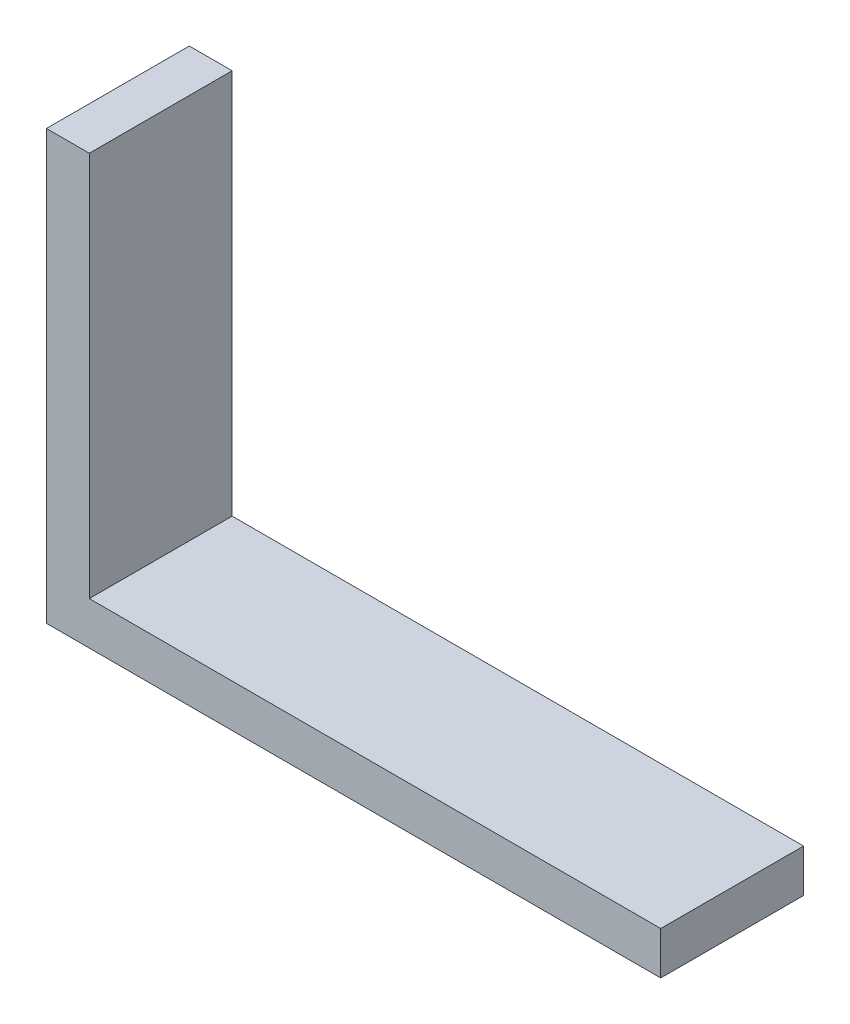
ISO-10303-21;
HEADER;
FILE_DESCRIPTION(('STEP AP214'),'2;1');
FILE_NAME('part.step','',(''),(''),'','','');
FILE_SCHEMA(('AUTOMOTIVE_DESIGN { 1 0 10303 214 1 1 1 1 }'));
ENDSEC;
DATA;
#1=APPLICATION_CONTEXT('core data for automotive mechanical design processes');
#2=APPLICATION_PROTOCOL_DEFINITION('international standard','automotive_design',2000,#1);
#3=PRODUCT_CONTEXT('',#1,'mechanical');
#4=PRODUCT('Part','Part','',(#3));
#5=PRODUCT_RELATED_PRODUCT_CATEGORY('part','',(#4));
#6=PRODUCT_DEFINITION_FORMATION('','',#4);
#7=PRODUCT_DEFINITION_CONTEXT('part definition',#1,'design');
#8=PRODUCT_DEFINITION('design','',#6,#7);
#9=PRODUCT_DEFINITION_SHAPE('','',#8);
#10=(LENGTH_UNIT() NAMED_UNIT(*) SI_UNIT(.MILLI.,.METRE.));
#11=(NAMED_UNIT(*) PLANE_ANGLE_UNIT() SI_UNIT($,.RADIAN.));
#12=(NAMED_UNIT(*) SI_UNIT($,.STERADIAN.) SOLID_ANGLE_UNIT());
#13=UNCERTAINTY_MEASURE_WITH_UNIT(LENGTH_MEASURE(1.E-05),#10,'distance_accuracy_value','');
#14=(GEOMETRIC_REPRESENTATION_CONTEXT(3) GLOBAL_UNCERTAINTY_ASSIGNED_CONTEXT((#13)) GLOBAL_UNIT_ASSIGNED_CONTEXT((#10,
#11,#12)) REPRESENTATION_CONTEXT('',''));
#15=CARTESIAN_POINT('',(0.,0.,0.));
#16=DIRECTION('',(0.,0.,1.));
#17=DIRECTION('',(1.,0.,0.));
#18=AXIS2_PLACEMENT_3D('',#15,#16,#17);
#19=CARTESIAN_POINT('',(43.,0.,10.));
#20=DIRECTION('',(0.,1.,0.));
#21=DIRECTION('',(-1.,0.,0.));
#22=AXIS2_PLACEMENT_3D('',#19,#20,#21);
#23=PLANE('',#22);
#24=DIRECTION('',(1.,0.,0.));
#25=VECTOR('',#24,1.);
#26=CARTESIAN_POINT('',(43.,0.,0.));
#27=LINE('',#26,#25);
#28=CARTESIAN_POINT('',(0.,0.,0.));
#29=VERTEX_POINT('',#28);
#30=CARTESIAN_POINT('',(43.,0.,0.));
#31=VERTEX_POINT('',#30);
#32=EDGE_CURVE('E123',#29,#31,#27,.T.);
#33=ORIENTED_EDGE('',*,*,#32,.T.);
#34=DIRECTION('',(0.,0.,-1.));
#35=VECTOR('',#34,1.);
#36=CARTESIAN_POINT('',(43.,0.,10.));
#37=LINE('',#36,#35);
#38=CARTESIAN_POINT('',(43.,0.,10.));
#39=VERTEX_POINT('',#38);
#40=EDGE_CURVE('E11',#39,#31,#37,.T.);
#41=ORIENTED_EDGE('',*,*,#40,.F.);
#42=DIRECTION('',(1.,0.,0.));
#43=VECTOR('',#42,1.);
#44=CARTESIAN_POINT('',(43.,0.,10.));
#45=LINE('',#44,#43);
#46=CARTESIAN_POINT('',(0.,0.,10.));
#47=VERTEX_POINT('',#46);
#48=EDGE_CURVE('E133',#47,#39,#45,.T.);
#49=ORIENTED_EDGE('',*,*,#48,.F.);
#50=DIRECTION('',(0.,0.,-1.));
#51=VECTOR('',#50,1.);
#52=CARTESIAN_POINT('',(0.,0.,10.));
#53=LINE('',#52,#51);
#54=EDGE_CURVE('E119',#47,#29,#53,.T.);
#55=ORIENTED_EDGE('',*,*,#54,.T.);
#56=EDGE_LOOP('',(#33,#41,#49,#55));
#57=FACE_BOUND('',#56,.T.);
#58=ADVANCED_FACE('F39',(#57),#23,.F.);
#59=CARTESIAN_POINT('',(43.,3.,10.));
#60=DIRECTION('',(-1.,0.,0.));
#61=DIRECTION('',(0.,-1.,0.));
#62=AXIS2_PLACEMENT_3D('',#59,#60,#61);
#63=PLANE('',#62);
#64=DIRECTION('',(0.,1.,0.));
#65=VECTOR('',#64,1.);
#66=CARTESIAN_POINT('',(43.,3.,0.));
#67=LINE('',#66,#65);
#68=CARTESIAN_POINT('',(43.,3.,0.));
#69=VERTEX_POINT('',#68);
#70=EDGE_CURVE('E126',#31,#69,#67,.T.);
#71=ORIENTED_EDGE('',*,*,#70,.T.);
#72=DIRECTION('',(0.,0.,-1.));
#73=VECTOR('',#72,1.);
#74=CARTESIAN_POINT('',(43.,3.,10.));
#75=LINE('',#74,#73);
#76=CARTESIAN_POINT('',(43.,3.,10.));
#77=VERTEX_POINT('',#76);
#78=EDGE_CURVE('E47',#77,#69,#75,.T.);
#79=ORIENTED_EDGE('',*,*,#78,.F.);
#80=DIRECTION('',(0.,1.,0.));
#81=VECTOR('',#80,1.);
#82=CARTESIAN_POINT('',(43.,3.,10.));
#83=LINE('',#82,#81);
#84=EDGE_CURVE('E92',#39,#77,#83,.T.);
#85=ORIENTED_EDGE('',*,*,#84,.F.);
#86=ORIENTED_EDGE('',*,*,#40,.T.);
#87=EDGE_LOOP('',(#71,#79,#85,#86));
#88=FACE_BOUND('',#87,.T.);
#89=ADVANCED_FACE('F157',(#88),#63,.F.);
#90=CARTESIAN_POINT('',(3.00000000000001,3.,10.));
#91=DIRECTION('',(0.,-1.,0.));
#92=DIRECTION('',(0.,0.,-1.));
#93=AXIS2_PLACEMENT_3D('',#90,#91,#92);
#94=PLANE('',#93);
#95=DIRECTION('',(-1.,0.,0.));
#96=VECTOR('',#95,1.);
#97=CARTESIAN_POINT('',(3.00000000000001,3.,0.));
#98=LINE('',#97,#96);
#99=CARTESIAN_POINT('',(3.00000000000001,3.,0.));
#100=VERTEX_POINT('',#99);
#101=EDGE_CURVE('E128',#69,#100,#98,.T.);
#102=ORIENTED_EDGE('',*,*,#101,.T.);
#103=DIRECTION('',(0.,0.,-1.));
#104=VECTOR('',#103,1.);
#105=CARTESIAN_POINT('',(3.00000000000001,3.,10.));
#106=LINE('',#105,#104);
#107=CARTESIAN_POINT('',(3.00000000000001,3.,10.));
#108=VERTEX_POINT('',#107);
#109=EDGE_CURVE('E114',#108,#100,#106,.T.);
#110=ORIENTED_EDGE('',*,*,#109,.F.);
#111=DIRECTION('',(-1.,0.,0.));
#112=VECTOR('',#111,1.);
#113=CARTESIAN_POINT('',(3.00000000000001,3.,10.));
#114=LINE('',#113,#112);
#115=EDGE_CURVE('E105',#77,#108,#114,.T.);
#116=ORIENTED_EDGE('',*,*,#115,.F.);
#117=ORIENTED_EDGE('',*,*,#78,.T.);
#118=EDGE_LOOP('',(#102,#110,#116,#117));
#119=FACE_BOUND('',#118,.T.);
#120=ADVANCED_FACE('F139',(#119),#94,.F.);
#121=CARTESIAN_POINT('',(3.,30.,10.));
#122=DIRECTION('',(-1.,0.,0.));
#123=DIRECTION('',(0.,-1.,0.));
#124=AXIS2_PLACEMENT_3D('',#121,#122,#123);
#125=PLANE('',#124);
#126=DIRECTION('',(0.,1.,0.));
#127=VECTOR('',#126,1.);
#128=CARTESIAN_POINT('',(3.,30.,0.));
#129=LINE('',#128,#127);
#130=CARTESIAN_POINT('',(3.,30.,0.));
#131=VERTEX_POINT('',#130);
#132=EDGE_CURVE('E113',#100,#131,#129,.T.);
#133=ORIENTED_EDGE('',*,*,#132,.T.);
#134=DIRECTION('',(0.,0.,-1.));
#135=VECTOR('',#134,1.);
#136=CARTESIAN_POINT('',(3.,30.,10.));
#137=LINE('',#136,#135);
#138=CARTESIAN_POINT('',(3.,30.,10.));
#139=VERTEX_POINT('',#138);
#140=EDGE_CURVE('E110',#139,#131,#137,.T.);
#141=ORIENTED_EDGE('',*,*,#140,.F.);
#142=DIRECTION('',(0.,1.,0.));
#143=VECTOR('',#142,1.);
#144=CARTESIAN_POINT('',(3.,30.,10.));
#145=LINE('',#144,#143);
#146=EDGE_CURVE('E99',#108,#139,#145,.T.);
#147=ORIENTED_EDGE('',*,*,#146,.F.);
#148=ORIENTED_EDGE('',*,*,#109,.T.);
#149=EDGE_LOOP('',(#133,#141,#147,#148));
#150=FACE_BOUND('',#149,.T.);
#151=ADVANCED_FACE('F111',(#150),#125,.F.);
#152=CARTESIAN_POINT('',(0.,30.,10.));
#153=DIRECTION('',(0.,-1.,0.));
#154=DIRECTION('',(0.,0.,-1.));
#155=AXIS2_PLACEMENT_3D('',#152,#153,#154);
#156=PLANE('',#155);
#157=DIRECTION('',(-1.,0.,0.));
#158=VECTOR('',#157,1.);
#159=CARTESIAN_POINT('',(0.,30.,0.));
#160=LINE('',#159,#158);
#161=CARTESIAN_POINT('',(0.,30.,0.));
#162=VERTEX_POINT('',#161);
#163=EDGE_CURVE('E78',#131,#162,#160,.T.);
#164=ORIENTED_EDGE('',*,*,#163,.T.);
#165=DIRECTION('',(0.,0.,-1.));
#166=VECTOR('',#165,1.);
#167=CARTESIAN_POINT('',(0.,30.,10.));
#168=LINE('',#167,#166);
#169=CARTESIAN_POINT('',(0.,30.,10.));
#170=VERTEX_POINT('',#169);
#171=EDGE_CURVE('E115',#170,#162,#168,.T.);
#172=ORIENTED_EDGE('',*,*,#171,.F.);
#173=DIRECTION('',(-1.,0.,0.));
#174=VECTOR('',#173,1.);
#175=CARTESIAN_POINT('',(0.,30.,10.));
#176=LINE('',#175,#174);
#177=EDGE_CURVE('E103',#139,#170,#176,.T.);
#178=ORIENTED_EDGE('',*,*,#177,.F.);
#179=ORIENTED_EDGE('',*,*,#140,.T.);
#180=EDGE_LOOP('',(#164,#172,#178,#179));
#181=FACE_BOUND('',#180,.T.);
#182=ADVANCED_FACE('F117',(#181),#156,.F.);
#183=CARTESIAN_POINT('',(0.,0.,10.));
#184=DIRECTION('',(1.,0.,0.));
#185=DIRECTION('',(0.,0.,-1.));
#186=AXIS2_PLACEMENT_3D('',#183,#184,#185);
#187=PLANE('',#186);
#188=DIRECTION('',(0.,-1.,0.));
#189=VECTOR('',#188,1.);
#190=CARTESIAN_POINT('',(0.,0.,0.));
#191=LINE('',#190,#189);
#192=EDGE_CURVE('E84',#162,#29,#191,.T.);
#193=ORIENTED_EDGE('',*,*,#192,.T.);
#194=ORIENTED_EDGE('',*,*,#54,.F.);
#195=DIRECTION('',(0.,-1.,0.));
#196=VECTOR('',#195,1.);
#197=CARTESIAN_POINT('',(0.,0.,10.));
#198=LINE('',#197,#196);
#199=EDGE_CURVE('E55',#170,#47,#198,.T.);
#200=ORIENTED_EDGE('',*,*,#199,.F.);
#201=ORIENTED_EDGE('',*,*,#171,.T.);
#202=EDGE_LOOP('',(#193,#194,#200,#201));
#203=FACE_BOUND('',#202,.T.);
#204=ADVANCED_FACE('F146',(#203),#187,.F.);
#205=CARTESIAN_POINT('',(0.,0.,10.));
#206=DIRECTION('',(0.,0.,-1.));
#207=DIRECTION('',(-1.,0.,0.));
#208=AXIS2_PLACEMENT_3D('',#205,#206,#207);
#209=PLANE('',#208);
#210=ORIENTED_EDGE('',*,*,#48,.T.);
#211=ORIENTED_EDGE('',*,*,#84,.T.);
#212=ORIENTED_EDGE('',*,*,#115,.T.);
#213=ORIENTED_EDGE('',*,*,#146,.T.);
#214=ORIENTED_EDGE('',*,*,#177,.T.);
#215=ORIENTED_EDGE('',*,*,#199,.T.);
#216=EDGE_LOOP('',(#210,#211,#212,#213,#214,#215));
#217=FACE_BOUND('',#216,.T.);
#218=ADVANCED_FACE('F101',(#217),#209,.F.);
#219=CARTESIAN_POINT('',(0.,0.,0.));
#220=DIRECTION('',(0.,0.,-1.));
#221=DIRECTION('',(-1.,0.,0.));
#222=AXIS2_PLACEMENT_3D('',#219,#220,#221);
#223=PLANE('',#222);
#224=ORIENTED_EDGE('',*,*,#32,.F.);
#225=ORIENTED_EDGE('',*,*,#192,.F.);
#226=ORIENTED_EDGE('',*,*,#163,.F.);
#227=ORIENTED_EDGE('',*,*,#132,.F.);
#228=ORIENTED_EDGE('',*,*,#101,.F.);
#229=ORIENTED_EDGE('',*,*,#70,.F.);
#230=EDGE_LOOP('',(#224,#225,#226,#227,#228,#229));
#231=FACE_BOUND('',#230,.T.);
#232=ADVANCED_FACE('F142',(#231),#223,.T.);
#233=CLOSED_SHELL('',(#58,#89,#120,#151,#182,#204,#218,#232));
#234=MANIFOLD_SOLID_BREP('B2',#233);
#235=ADVANCED_BREP_SHAPE_REPRESENTATION('',(#18,#234),#14);
#236=SHAPE_DEFINITION_REPRESENTATION(#9,#235);
ENDSEC;
END-ISO-10303-21;
